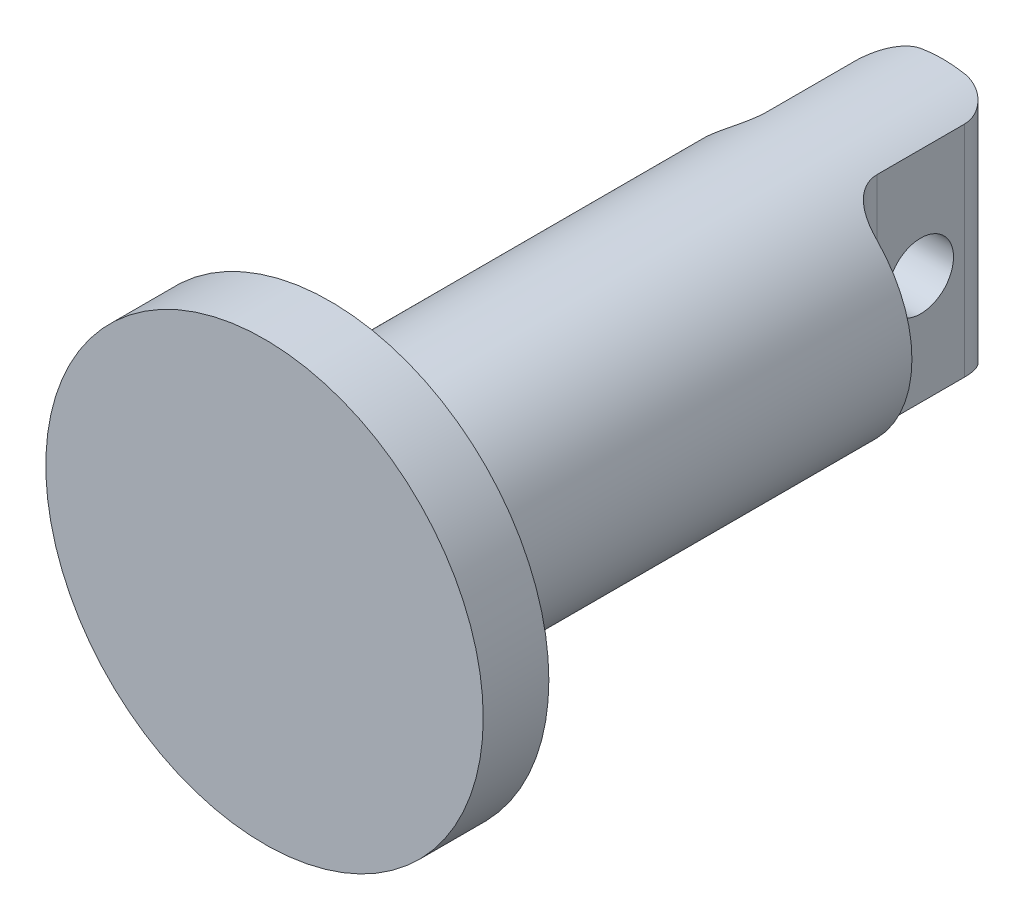
ISO-10303-21;
HEADER;
FILE_DESCRIPTION(('STEP AP214'),'2;1');
FILE_NAME('part.step','',(''),(''),'','','');
FILE_SCHEMA(('AUTOMOTIVE_DESIGN { 1 0 10303 214 1 1 1 1 }'));
ENDSEC;
DATA;
#1=APPLICATION_CONTEXT('core data for automotive mechanical design processes');
#2=APPLICATION_PROTOCOL_DEFINITION('international standard','automotive_design',2000,#1);
#3=PRODUCT_CONTEXT('',#1,'mechanical');
#4=PRODUCT('Part','Part','',(#3));
#5=PRODUCT_RELATED_PRODUCT_CATEGORY('part','',(#4));
#6=PRODUCT_DEFINITION_FORMATION('','',#4);
#7=PRODUCT_DEFINITION_CONTEXT('part definition',#1,'design');
#8=PRODUCT_DEFINITION('design','',#6,#7);
#9=PRODUCT_DEFINITION_SHAPE('','',#8);
#10=(LENGTH_UNIT() NAMED_UNIT(*) SI_UNIT(.MILLI.,.METRE.));
#11=(NAMED_UNIT(*) PLANE_ANGLE_UNIT() SI_UNIT($,.RADIAN.));
#12=(NAMED_UNIT(*) SI_UNIT($,.STERADIAN.) SOLID_ANGLE_UNIT());
#13=UNCERTAINTY_MEASURE_WITH_UNIT(LENGTH_MEASURE(1.E-05),#10,'distance_accuracy_value','');
#14=(GEOMETRIC_REPRESENTATION_CONTEXT(3) GLOBAL_UNCERTAINTY_ASSIGNED_CONTEXT((#13)) GLOBAL_UNIT_ASSIGNED_CONTEXT((#10,
#11,#12)) REPRESENTATION_CONTEXT('',''));
#15=CARTESIAN_POINT('',(0.,0.,0.));
#16=DIRECTION('',(0.,0.,1.));
#17=DIRECTION('',(1.,0.,0.));
#18=AXIS2_PLACEMENT_3D('',#15,#16,#17);
#19=CARTESIAN_POINT('',(0.,0.,0.));
#20=DIRECTION('',(0.,0.,1.));
#21=DIRECTION('',(1.,0.,0.));
#22=AXIS2_PLACEMENT_3D('',#19,#20,#21);
#23=PLANE('',#22);
#24=CARTESIAN_POINT('',(0.,0.,0.));
#25=DIRECTION('',(0.,0.,1.));
#26=DIRECTION('',(1.,0.,0.));
#27=AXIS2_PLACEMENT_3D('',#24,#25,#26);
#28=CIRCLE('',#27,8.6);
#29=CARTESIAN_POINT('',(8.6,0.,0.));
#30=VERTEX_POINT('',#29);
#31=EDGE_CURVE('E109',#30,#30,#28,.T.);
#32=ORIENTED_EDGE('',*,*,#31,.T.);
#33=EDGE_LOOP('',(#32));
#34=FACE_BOUND('',#33,.T.);
#35=CARTESIAN_POINT('',(0.,0.,0.));
#36=DIRECTION('',(0.,0.,1.));
#37=DIRECTION('',(1.,0.,0.));
#38=AXIS2_PLACEMENT_3D('',#35,#36,#37);
#39=CIRCLE('',#38,10.);
#40=CARTESIAN_POINT('',(10.,0.,0.));
#41=VERTEX_POINT('',#40);
#42=EDGE_CURVE('E234',#41,#41,#39,.T.);
#43=ORIENTED_EDGE('',*,*,#42,.F.);
#44=EDGE_LOOP('',(#43));
#45=FACE_BOUND('',#44,.T.);
#46=ADVANCED_FACE('F36',(#34,#45),#23,.F.);
#47=CARTESIAN_POINT('',(0.,0.,3.));
#48=DIRECTION('',(0.,0.,-1.));
#49=DIRECTION('',(-1.,0.,0.));
#50=AXIS2_PLACEMENT_3D('',#47,#48,#49);
#51=CYLINDRICAL_SURFACE('',#50,10.);
#52=CARTESIAN_POINT('',(0.,0.,3.));
#53=DIRECTION('',(0.,0.,1.));
#54=DIRECTION('',(1.,0.,0.));
#55=AXIS2_PLACEMENT_3D('',#52,#53,#54);
#56=CIRCLE('',#55,10.);
#57=CARTESIAN_POINT('',(10.,0.,3.));
#58=VERTEX_POINT('',#57);
#59=EDGE_CURVE('E355',#58,#58,#56,.T.);
#60=ORIENTED_EDGE('',*,*,#59,.F.);
#61=EDGE_LOOP('',(#60));
#62=FACE_BOUND('',#61,.T.);
#63=ORIENTED_EDGE('',*,*,#42,.T.);
#64=EDGE_LOOP('',(#63));
#65=FACE_BOUND('',#64,.T.);
#66=ADVANCED_FACE('F198',(#62,#65),#51,.T.);
#67=CARTESIAN_POINT('',(0.,0.,3.));
#68=DIRECTION('',(0.,0.,1.));
#69=DIRECTION('',(1.,0.,0.));
#70=AXIS2_PLACEMENT_3D('',#67,#68,#69);
#71=PLANE('',#70);
#72=ORIENTED_EDGE('',*,*,#59,.T.);
#73=EDGE_LOOP('',(#72));
#74=FACE_BOUND('',#73,.T.);
#75=ADVANCED_FACE('F152',(#74),#71,.T.);
#76=CARTESIAN_POINT('',(0.,0.,-28.));
#77=DIRECTION('',(0.,0.,1.));
#78=DIRECTION('',(1.,0.,0.));
#79=AXIS2_PLACEMENT_3D('',#76,#77,#78);
#80=CYLINDRICAL_SURFACE('',#79,5.6);
#81=CARTESIAN_POINT('',(0.,0.,-3.));
#82=DIRECTION('',(0.,0.,1.));
#83=DIRECTION('',(1.,0.,0.));
#84=AXIS2_PLACEMENT_3D('',#81,#82,#83);
#85=CIRCLE('',#84,5.6);
#86=CARTESIAN_POINT('',(5.6,0.,-3.));
#87=VERTEX_POINT('',#86);
#88=EDGE_CURVE('E124',#87,#87,#85,.F.);
#89=ORIENTED_EDGE('',*,*,#88,.T.);
#90=EDGE_LOOP('',(#89));
#91=FACE_BOUND('',#90,.T.);
#92=DIRECTION('',(0.,0.,1.));
#93=VECTOR('',#92,1.);
#94=CARTESIAN_POINT('',(-2.5,-5.01098792654702,-28.));
#95=LINE('',#94,#93);
#96=CARTESIAN_POINT('',(-2.5,-5.01098792654702,-22.5));
#97=VERTEX_POINT('',#96);
#98=CARTESIAN_POINT('',(-2.5,-5.01098792654702,-26.5));
#99=VERTEX_POINT('',#98);
#100=EDGE_CURVE('E107',#97,#99,#95,.F.);
#101=ORIENTED_EDGE('',*,*,#100,.T.);
#102=CARTESIAN_POINT('',(-2.5,-5.01098792654702,-26.5));
#103=CARTESIAN_POINT('',(-2.5000020804932,-5.01098386540568,-26.5395725011254));
#104=CARTESIAN_POINT('',(-2.49843294481036,-5.01177002350182,-26.5791239922962));
#105=CARTESIAN_POINT('',(-2.49218861536451,-5.01487928972236,-26.6579048751711));
#106=CARTESIAN_POINT('',(-2.48751464530948,-5.017201792326,-26.6971343876123));
#107=CARTESIAN_POINT('',(-2.46895310911888,-5.02637746679336,-26.8135594581204));
#108=CARTESIAN_POINT('',(-2.45052502289085,-5.03543974754558,-26.88991104718));
#109=CARTESIAN_POINT('',(-2.40237161237888,-5.05858790620674,-27.0379794446277));
#110=CARTESIAN_POINT('',(-2.37265886624782,-5.07266818985616,-27.1097013096591));
#111=CARTESIAN_POINT('',(-2.30298371585328,-5.10467755632711,-27.2471099442359));
#112=CARTESIAN_POINT('',(-2.2630111953227,-5.12261043499499,-27.312790669817));
#113=CARTESIAN_POINT('',(-2.17141281857219,-5.16213023737658,-27.4403776451357));
#114=CARTESIAN_POINT('',(-2.11924950501062,-5.18386787648468,-27.5018504279728));
#115=CARTESIAN_POINT('',(-2.00607340449965,-5.22870677700186,-27.615459784027));
#116=CARTESIAN_POINT('',(-1.94505678929908,-5.25180862573225,-27.6675922965179));
#117=CARTESIAN_POINT('',(-1.81019268688119,-5.29987993214784,-27.7653363169122));
#118=CARTESIAN_POINT('',(-1.73570424955865,-5.32484780646085,-27.8100673581615));
#119=CARTESIAN_POINT('',(-1.57974465073417,-5.37317998442629,-27.886151142896));
#120=CARTESIAN_POINT('',(-1.49827861035609,-5.39654544185285,-27.9175135987391));
#121=CARTESIAN_POINT('',(-1.34760565609259,-5.43587189487601,-27.960819199001));
#122=CARTESIAN_POINT('',(-1.27929438996599,-5.45237039149003,-27.9754206613721));
#123=CARTESIAN_POINT('',(-1.14076362477681,-5.48304543588229,-27.9950256519124));
#124=CARTESIAN_POINT('',(-1.07054304586715,-5.49722063643315,-28.0000236291209));
#125=CARTESIAN_POINT('',(-1.,-5.50999092558236,-28.));
#126=B_SPLINE_CURVE_WITH_KNOTS('',3,(#102,#103,#104,#105,#106,#107,#108,#109,#110,#111,#112,
#113,#114,#115,#116,#117,#118,#119,#120,#121,#122,#123,#124,#125),.UNSPECIFIED.,.F.,.F.,(4,2,2,
2,2,2,2,2,2,2,2,4),(0.,0.118637964226892,0.237229197409221,0.473170501747675,0.708849588412842,
0.944761956370705,1.19422423603551,1.44379470880183,1.7137504722233,1.98350977549837,
2.19815830777773,2.41293087289718),.UNSPECIFIED.);
#127=CARTESIAN_POINT('',(-1.,-5.50999092558236,-28.));
#128=VERTEX_POINT('',#127);
#129=EDGE_CURVE('E167',#99,#128,#126,.T.);
#130=ORIENTED_EDGE('',*,*,#129,.T.);
#131=CARTESIAN_POINT('',(0.,0.,-28.));
#132=DIRECTION('',(0.,0.,-1.));
#133=DIRECTION('',(-1.,0.,0.));
#134=AXIS2_PLACEMENT_3D('',#131,#132,#133);
#135=CIRCLE('',#134,5.6);
#136=CARTESIAN_POINT('',(1.,-5.50999092558236,-28.));
#137=VERTEX_POINT('',#136);
#138=EDGE_CURVE('E235',#137,#128,#135,.T.);
#139=ORIENTED_EDGE('',*,*,#138,.F.);
#140=CARTESIAN_POINT('',(1.,-5.50999092558236,-28.));
#141=CARTESIAN_POINT('',(1.0431357750744,-5.50216525904986,-28.0000002889022));
#142=CARTESIAN_POINT('',(1.08615359317973,-5.49383123010131,-27.9981384460265));
#143=CARTESIAN_POINT('',(1.17166685141476,-5.47623015731936,-27.9907624586411));
#144=CARTESIAN_POINT('',(1.21416247296195,-5.46696344841963,-27.9852496212957));
#145=CARTESIAN_POINT('',(1.3401887639641,-5.43794852352108,-27.9633914739219));
#146=CARTESIAN_POINT('',(1.42256390588289,-5.41692970323941,-27.9417254477834));
#147=CARTESIAN_POINT('',(1.58180278663491,-5.37259209995911,-27.8851540203785));
#148=CARTESIAN_POINT('',(1.65867169675423,-5.34927552517556,-27.8502612403694));
#149=CARTESIAN_POINT('',(1.80531751706315,-5.30158259710547,-27.7682756767982));
#150=CARTESIAN_POINT('',(1.87508918255689,-5.2772054788231,-27.7211739610188));
#151=CARTESIAN_POINT('',(2.00835566901939,-5.22797720762672,-27.6139160966464));
#152=CARTESIAN_POINT('',(2.07151596208769,-5.20314268003664,-27.5533357924905));
#153=CARTESIAN_POINT('',(2.18673797636213,-5.15577972730389,-27.4215791801319));
#154=CARTESIAN_POINT('',(2.23879824157279,-5.1332516048946,-27.3504014839417));
#155=CARTESIAN_POINT('',(2.32948785162619,-5.0927330594954,-27.2000525597936));
#156=CARTESIAN_POINT('',(2.36827835891485,-5.07468897321799,-27.1209935103895));
#157=CARTESIAN_POINT('',(2.43160009913251,-5.04465718708589,-26.9563554350108));
#158=CARTESIAN_POINT('',(2.45616029662659,-5.03265719156463,-26.8707900567923));
#159=CARTESIAN_POINT('',(2.48193557874058,-5.01996911315989,-26.7369083960247));
#160=CARTESIAN_POINT('',(2.48869640698838,-5.01661546402954,-26.6898457537173));
#161=CARTESIAN_POINT('',(2.49773104489937,-5.01212031245242,-26.5951999860403));
#162=CARTESIAN_POINT('',(2.50000596090449,-5.01097826456884,-26.5476169919148));
#163=CARTESIAN_POINT('',(2.5,-5.01098792654702,-26.5));
#164=B_SPLINE_CURVE_WITH_KNOTS('',3,(#140,#141,#142,#143,#144,#145,#146,#147,#148,#149,#150,
#151,#152,#153,#154,#155,#156,#157,#158,#159,#160,#161,#162,#163),.UNSPECIFIED.,.F.,.F.,(4,2,2,
2,2,2,2,2,2,2,2,4),(0.,0.131429504807568,0.262811979376038,0.524658963023519,0.786256712976935,
1.04804639414124,1.31967659915426,1.59134241212977,1.85958079849224,2.12727127325902,
2.27002499369473,2.4127435029665),.UNSPECIFIED.);
#165=CARTESIAN_POINT('',(2.5,-5.01098792654702,-26.5));
#166=VERTEX_POINT('',#165);
#167=EDGE_CURVE('E132',#137,#166,#164,.T.);
#168=ORIENTED_EDGE('',*,*,#167,.T.);
#169=DIRECTION('',(0.,0.,1.));
#170=VECTOR('',#169,1.);
#171=CARTESIAN_POINT('',(2.5,-5.01098792654702,-28.));
#172=LINE('',#171,#170);
#173=CARTESIAN_POINT('',(2.5,-5.01098792654702,-22.5));
#174=VERTEX_POINT('',#173);
#175=EDGE_CURVE('E119',#166,#174,#172,.T.);
#176=ORIENTED_EDGE('',*,*,#175,.T.);
#177=CARTESIAN_POINT('',(2.5,-5.01098792654702,-22.5));
#178=CARTESIAN_POINT('',(2.49999844532188,-5.01098605975963,-22.4616087248729));
#179=CARTESIAN_POINT('',(2.50147503292777,-5.01025231108213,-22.4232363931987));
#180=CARTESIAN_POINT('',(2.50735348108305,-5.00731410603619,-22.3467785175572));
#181=CARTESIAN_POINT('',(2.51175493108791,-5.00510985607259,-22.3086929340996));
#182=CARTESIAN_POINT('',(2.52926194656355,-4.99630013425496,-22.1954739584162));
#183=CARTESIAN_POINT('',(2.54667063879383,-4.98749773902104,-22.1211207884798));
#184=CARTESIAN_POINT('',(2.59216946245848,-4.96400076184108,-21.9767905047417));
#185=CARTESIAN_POINT('',(2.62026021251362,-4.94930583864348,-21.9068136446547));
#186=CARTESIAN_POINT('',(2.68583584980902,-4.91402750126924,-21.7730039536221));
#187=CARTESIAN_POINT('',(2.72332327114746,-4.89344249844124,-21.709172786487));
#188=CARTESIAN_POINT('',(2.80690028343339,-4.8459942461289,-21.5878278514886));
#189=CARTESIAN_POINT('',(2.85315683574015,-4.81900603636376,-21.5304785632747));
#190=CARTESIAN_POINT('',(2.95167990030185,-4.75929602991547,-21.4247089164592));
#191=CARTESIAN_POINT('',(3.00394464051543,-4.72657592230139,-21.3762859360669));
#192=CARTESIAN_POINT('',(3.11692455378362,-4.65292232365463,-21.2851460559756));
#193=CARTESIAN_POINT('',(3.1779812305425,-4.61153525982092,-21.2432230603618));
#194=CARTESIAN_POINT('',(3.30259788637748,-4.52312917531629,-21.1700105708581));
#195=CARTESIAN_POINT('',(3.36616437104541,-4.476094772014,-21.1387510539356));
#196=CARTESIAN_POINT('',(3.47863230154504,-4.38895526792786,-21.0925366978604));
#197=CARTESIAN_POINT('',(3.52745519326801,-4.34983358810063,-21.0754750754576));
#198=CARTESIAN_POINT('',(3.624733043728,-4.26911086138937,-21.0468148597547));
#199=CARTESIAN_POINT('',(3.67318758591487,-4.2275073753211,-21.0352217441161));
#200=CARTESIAN_POINT('',(3.76886997937974,-4.14242568117838,-21.0171181181185));
#201=CARTESIAN_POINT('',(3.8161032057753,-4.09895936269225,-21.0105793259212));
#202=CARTESIAN_POINT('',(3.90916509774067,-4.01030876341671,-21.0020267392921));
#203=CARTESIAN_POINT('',(3.95499655700509,-3.96512836484636,-21.0000032754364));
#204=CARTESIAN_POINT('',(4.,-3.91918358845308,-21.));
#205=B_SPLINE_CURVE_WITH_KNOTS('',3,(#177,#178,#179,#180,#181,#182,#183,#184,#185,#186,#187,
#188,#189,#190,#191,#192,#193,#194,#195,#196,#197,#198,#199,#200,#201,#202,#203,#204),
.UNSPECIFIED.,.F.,.F.,(4,2,2,2,2,2,2,2,2,2,2,2,2,4),(0.,0.115101046934983,0.230185941272074,
0.459593197899067,0.689013742013863,0.918496223045591,1.15289102850619,1.38721687860824,
1.64076447615015,1.8950190787028,2.089284445406,2.28374399162558,2.47710738617681,
2.6700563005188),.UNSPECIFIED.);
#206=CARTESIAN_POINT('',(4.,-3.91918358845308,-21.));
#207=VERTEX_POINT('',#206);
#208=EDGE_CURVE('E12',#174,#207,#205,.T.);
#209=ORIENTED_EDGE('',*,*,#208,.T.);
#210=CARTESIAN_POINT('',(0.,0.,-21.));
#211=DIRECTION('',(0.,0.,-1.));
#212=DIRECTION('',(-1.,0.,0.));
#213=AXIS2_PLACEMENT_3D('',#210,#211,#212);
#214=CIRCLE('',#213,5.6);
#215=CARTESIAN_POINT('',(4.,3.91918358845308,-21.));
#216=VERTEX_POINT('',#215);
#217=EDGE_CURVE('E122',#216,#207,#214,.T.);
#218=ORIENTED_EDGE('',*,*,#217,.F.);
#219=CARTESIAN_POINT('',(4.,3.91918358845308,-21.));
#220=CARTESIAN_POINT('',(3.9557336803865,3.96437492473145,-21.0000033469822));
#221=CARTESIAN_POINT('',(3.91066820298925,4.00882603571216,-21.001960904263));
#222=CARTESIAN_POINT('',(3.81918676707573,4.09607014262874,-21.0102269052185));
#223=CARTESIAN_POINT('',(3.77276836887405,4.1388597710828,-21.0165437429517));
#224=CARTESIAN_POINT('',(3.67865738367702,4.22273424589004,-21.0340382842501));
#225=CARTESIAN_POINT('',(3.63095793272987,4.26380422561554,-21.0452514247408));
#226=CARTESIAN_POINT('',(3.53517126489213,4.34355264612186,-21.0729679651696));
#227=CARTESIAN_POINT('',(3.48708440180229,4.38223303908223,-21.0894669767605));
#228=CARTESIAN_POINT('',(3.36770023341093,4.47512441155301,-21.1376084788785));
#229=CARTESIAN_POINT('',(3.29649458651222,4.52773396683387,-21.1727131624566));
#230=CARTESIAN_POINT('',(3.15741936012218,4.62578965948223,-21.2563691011738));
#231=CARTESIAN_POINT('',(3.08954041268094,4.67125681502645,-21.3048796978459));
#232=CARTESIAN_POINT('',(2.95967539347949,4.75461124064817,-21.4159885788762));
#233=CARTESIAN_POINT('',(2.8977435397363,4.7924317165616,-21.4787016416199));
#234=CARTESIAN_POINT('',(2.7841641032247,4.85930002163556,-21.6169749042305));
#235=CARTESIAN_POINT('',(2.73251858454951,4.88834609069483,-21.6925376769387));
#236=CARTESIAN_POINT('',(2.64857801238486,4.9342724729647,-21.844085980049));
#237=CARTESIAN_POINT('',(2.6146816186877,4.95221168523887,-21.918868913277));
#238=CARTESIAN_POINT('',(2.55937136974278,4.98102422435756,-22.074143720394));
#239=CARTESIAN_POINT('',(2.5379390462439,4.99190800812404,-22.1546269485125));
#240=CARTESIAN_POINT('',(2.51557298798128,5.00319512688941,-22.2799333289134));
#241=CARTESIAN_POINT('',(2.5097391768057,5.00612014491925,-22.3237216604271));
#242=CARTESIAN_POINT('',(2.50195365053542,5.01001359195367,-22.4116649506208));
#243=CARTESIAN_POINT('',(2.49999639781366,5.01098481197141,-22.4558192957153));
#244=CARTESIAN_POINT('',(2.5,5.01098792654702,-22.5));
#245=B_SPLINE_CURVE_WITH_KNOTS('',3,(#219,#220,#221,#222,#223,#224,#225,#226,#227,#228,#229,
#230,#231,#232,#233,#234,#235,#236,#237,#238,#239,#240,#241,#242,#243,#244),.UNSPECIFIED.,.F.,
.F.,(4,2,2,2,2,2,2,2,2,2,2,2,4),(0.,0.189784007279752,0.379934478566911,0.571484582290015,
0.762876070802287,1.04739762955487,1.33106556508882,1.61711342007846,1.90321861676456,
2.15402154935302,2.40445190932844,2.53707794764393,2.66951439388349),.UNSPECIFIED.);
#246=CARTESIAN_POINT('',(2.5,5.01098792654702,-22.5));
#247=VERTEX_POINT('',#246);
#248=EDGE_CURVE('E48',#216,#247,#245,.T.);
#249=ORIENTED_EDGE('',*,*,#248,.T.);
#250=DIRECTION('',(0.,0.,1.));
#251=VECTOR('',#250,1.);
#252=CARTESIAN_POINT('',(2.5,5.01098792654702,-28.));
#253=LINE('',#252,#251);
#254=CARTESIAN_POINT('',(2.5,5.01098792654702,-26.5));
#255=VERTEX_POINT('',#254);
#256=EDGE_CURVE('E227',#247,#255,#253,.F.);
#257=ORIENTED_EDGE('',*,*,#256,.T.);
#258=CARTESIAN_POINT('',(2.5,5.01098792654702,-26.5));
#259=CARTESIAN_POINT('',(2.5000020804932,5.01098386540568,-26.5395725011254));
#260=CARTESIAN_POINT('',(2.49843294481036,5.01177002350182,-26.5791239922962));
#261=CARTESIAN_POINT('',(2.49218861536451,5.01487928972236,-26.6579048751711));
#262=CARTESIAN_POINT('',(2.48751464530948,5.017201792326,-26.6971343876123));
#263=CARTESIAN_POINT('',(2.46895310911888,5.02637746679336,-26.8135594581204));
#264=CARTESIAN_POINT('',(2.45052502289085,5.03543974754558,-26.88991104718));
#265=CARTESIAN_POINT('',(2.40237161237888,5.05858790620674,-27.0379794446277));
#266=CARTESIAN_POINT('',(2.37265886624782,5.07266818985616,-27.1097013096591));
#267=CARTESIAN_POINT('',(2.30298371585328,5.10467755632711,-27.2471099442359));
#268=CARTESIAN_POINT('',(2.2630111953227,5.12261043499499,-27.312790669817));
#269=CARTESIAN_POINT('',(2.17141281857219,5.16213023737658,-27.4403776451357));
#270=CARTESIAN_POINT('',(2.11924950501062,5.18386787648468,-27.5018504279728));
#271=CARTESIAN_POINT('',(2.00607340449965,5.22870677700186,-27.615459784027));
#272=CARTESIAN_POINT('',(1.94505678929908,5.25180862573225,-27.6675922965179));
#273=CARTESIAN_POINT('',(1.81019268688119,5.29987993214784,-27.7653363169122));
#274=CARTESIAN_POINT('',(1.73570424955865,5.32484780646085,-27.8100673581615));
#275=CARTESIAN_POINT('',(1.57974465073417,5.37317998442629,-27.886151142896));
#276=CARTESIAN_POINT('',(1.49827861035609,5.39654544185285,-27.9175135987391));
#277=CARTESIAN_POINT('',(1.34760565609259,5.43587189487601,-27.960819199001));
#278=CARTESIAN_POINT('',(1.27929438996599,5.45237039149003,-27.9754206613721));
#279=CARTESIAN_POINT('',(1.14076362477681,5.48304543588229,-27.9950256519124));
#280=CARTESIAN_POINT('',(1.07054304586715,5.49722063643315,-28.0000236291209));
#281=CARTESIAN_POINT('',(1.,5.50999092558236,-28.));
#282=B_SPLINE_CURVE_WITH_KNOTS('',3,(#258,#259,#260,#261,#262,#263,#264,#265,#266,#267,#268,
#269,#270,#271,#272,#273,#274,#275,#276,#277,#278,#279,#280,#281),.UNSPECIFIED.,.F.,.F.,(4,2,2,
2,2,2,2,2,2,2,2,4),(0.,0.118637964226892,0.237229197409221,0.473170501747675,0.708849588412842,
0.944761956370705,1.19422423603551,1.44379470880183,1.7137504722233,1.98350977549837,
2.19815830777773,2.41293087289718),.UNSPECIFIED.);
#283=CARTESIAN_POINT('',(1.,5.50999092558236,-28.));
#284=VERTEX_POINT('',#283);
#285=EDGE_CURVE('E138',#255,#284,#282,.T.);
#286=ORIENTED_EDGE('',*,*,#285,.T.);
#287=CARTESIAN_POINT('',(-1.,5.50999092558236,-28.));
#288=VERTEX_POINT('',#287);
#289=EDGE_CURVE('E225',#288,#284,#135,.T.);
#290=ORIENTED_EDGE('',*,*,#289,.F.);
#291=CARTESIAN_POINT('',(-1.,5.50999092558236,-28.));
#292=CARTESIAN_POINT('',(-1.0431357750744,5.50216525904986,-28.0000002889022));
#293=CARTESIAN_POINT('',(-1.08615359317973,5.49383123010131,-27.9981384460265));
#294=CARTESIAN_POINT('',(-1.17166685141476,5.47623015731936,-27.9907624586411));
#295=CARTESIAN_POINT('',(-1.21416247296195,5.46696344841963,-27.9852496212957));
#296=CARTESIAN_POINT('',(-1.3401887639641,5.43794852352108,-27.9633914739219));
#297=CARTESIAN_POINT('',(-1.42256390588289,5.41692970323941,-27.9417254477834));
#298=CARTESIAN_POINT('',(-1.58180278663491,5.37259209995911,-27.8851540203785));
#299=CARTESIAN_POINT('',(-1.65867169675423,5.34927552517556,-27.8502612403694));
#300=CARTESIAN_POINT('',(-1.80531751706315,5.30158259710547,-27.7682756767982));
#301=CARTESIAN_POINT('',(-1.87508918255689,5.2772054788231,-27.7211739610188));
#302=CARTESIAN_POINT('',(-2.00835566901939,5.22797720762672,-27.6139160966464));
#303=CARTESIAN_POINT('',(-2.07151596208769,5.20314268003664,-27.5533357924905));
#304=CARTESIAN_POINT('',(-2.18673797636213,5.15577972730389,-27.4215791801319));
#305=CARTESIAN_POINT('',(-2.23879824157279,5.1332516048946,-27.3504014839417));
#306=CARTESIAN_POINT('',(-2.32948785162619,5.0927330594954,-27.2000525597936));
#307=CARTESIAN_POINT('',(-2.36827835891485,5.07468897321799,-27.1209935103895));
#308=CARTESIAN_POINT('',(-2.43160009913251,5.04465718708589,-26.9563554350108));
#309=CARTESIAN_POINT('',(-2.45616029662659,5.03265719156463,-26.8707900567923));
#310=CARTESIAN_POINT('',(-2.48193557874058,5.01996911315989,-26.7369083960247));
#311=CARTESIAN_POINT('',(-2.48869640698838,5.01661546402954,-26.6898457537173));
#312=CARTESIAN_POINT('',(-2.49773104489937,5.01212031245242,-26.5951999860403));
#313=CARTESIAN_POINT('',(-2.50000596090449,5.01097826456884,-26.5476169919148));
#314=CARTESIAN_POINT('',(-2.5,5.01098792654702,-26.5));
#315=B_SPLINE_CURVE_WITH_KNOTS('',3,(#291,#292,#293,#294,#295,#296,#297,#298,#299,#300,#301,
#302,#303,#304,#305,#306,#307,#308,#309,#310,#311,#312,#313,#314),.UNSPECIFIED.,.F.,.F.,(4,2,2,
2,2,2,2,2,2,2,2,4),(0.,0.131429504807568,0.262811979376038,0.524658963023519,0.786256712976935,
1.04804639414124,1.31967659915426,1.59134241212977,1.85958079849224,2.12727127325902,
2.27002499369473,2.4127435029665),.UNSPECIFIED.);
#316=CARTESIAN_POINT('',(-2.5,5.01098792654702,-26.5));
#317=VERTEX_POINT('',#316);
#318=EDGE_CURVE('E161',#288,#317,#315,.T.);
#319=ORIENTED_EDGE('',*,*,#318,.T.);
#320=DIRECTION('',(0.,0.,1.));
#321=VECTOR('',#320,1.);
#322=CARTESIAN_POINT('',(-2.5,5.01098792654702,-28.));
#323=LINE('',#322,#321);
#324=CARTESIAN_POINT('',(-2.5,5.01098792654702,-22.5));
#325=VERTEX_POINT('',#324);
#326=EDGE_CURVE('E118',#317,#325,#323,.T.);
#327=ORIENTED_EDGE('',*,*,#326,.T.);
#328=CARTESIAN_POINT('',(-2.5,5.01098792654702,-22.5));
#329=CARTESIAN_POINT('',(-2.49999844532188,5.01098605975963,-22.4616087248729));
#330=CARTESIAN_POINT('',(-2.50147503292777,5.01025231108213,-22.4232363931987));
#331=CARTESIAN_POINT('',(-2.50735348108305,5.00731410603619,-22.3467785175572));
#332=CARTESIAN_POINT('',(-2.51175493108791,5.00510985607259,-22.3086929340996));
#333=CARTESIAN_POINT('',(-2.52926194656355,4.99630013425496,-22.1954739584162));
#334=CARTESIAN_POINT('',(-2.54667063879383,4.98749773902104,-22.1211207884798));
#335=CARTESIAN_POINT('',(-2.59216946245848,4.96400076184108,-21.9767905047417));
#336=CARTESIAN_POINT('',(-2.62026021251362,4.94930583864348,-21.9068136446547));
#337=CARTESIAN_POINT('',(-2.68583584980902,4.91402750126924,-21.7730039536221));
#338=CARTESIAN_POINT('',(-2.72332327114746,4.89344249844124,-21.709172786487));
#339=CARTESIAN_POINT('',(-2.80690028343339,4.8459942461289,-21.5878278514886));
#340=CARTESIAN_POINT('',(-2.85315683574015,4.81900603636376,-21.5304785632747));
#341=CARTESIAN_POINT('',(-2.95167990030185,4.75929602991547,-21.4247089164592));
#342=CARTESIAN_POINT('',(-3.00394464051543,4.72657592230139,-21.3762859360669));
#343=CARTESIAN_POINT('',(-3.11692455378362,4.65292232365463,-21.2851460559756));
#344=CARTESIAN_POINT('',(-3.1779812305425,4.61153525982092,-21.2432230603618));
#345=CARTESIAN_POINT('',(-3.30259788637748,4.52312917531629,-21.1700105708581));
#346=CARTESIAN_POINT('',(-3.36616437104541,4.476094772014,-21.1387510539356));
#347=CARTESIAN_POINT('',(-3.47863230154504,4.38895526792786,-21.0925366978604));
#348=CARTESIAN_POINT('',(-3.52745519326801,4.34983358810063,-21.0754750754576));
#349=CARTESIAN_POINT('',(-3.624733043728,4.26911086138937,-21.0468148597547));
#350=CARTESIAN_POINT('',(-3.67318758591487,4.2275073753211,-21.0352217441161));
#351=CARTESIAN_POINT('',(-3.76886997937974,4.14242568117838,-21.0171181181185));
#352=CARTESIAN_POINT('',(-3.8161032057753,4.09895936269225,-21.0105793259212));
#353=CARTESIAN_POINT('',(-3.90916509774067,4.01030876341671,-21.0020267392921));
#354=CARTESIAN_POINT('',(-3.95499655700509,3.96512836484636,-21.0000032754364));
#355=CARTESIAN_POINT('',(-4.,3.91918358845308,-21.));
#356=B_SPLINE_CURVE_WITH_KNOTS('',3,(#328,#329,#330,#331,#332,#333,#334,#335,#336,#337,#338,
#339,#340,#341,#342,#343,#344,#345,#346,#347,#348,#349,#350,#351,#352,#353,#354,#355),
.UNSPECIFIED.,.F.,.F.,(4,2,2,2,2,2,2,2,2,2,2,2,2,4),(0.,0.115101046934983,0.230185941272074,
0.459593197899067,0.689013742013863,0.918496223045591,1.15289102850619,1.38721687860824,
1.64076447615015,1.8950190787028,2.089284445406,2.28374399162558,2.47710738617681,
2.6700563005188),.UNSPECIFIED.);
#357=CARTESIAN_POINT('',(-4.,3.91918358845308,-21.));
#358=VERTEX_POINT('',#357);
#359=EDGE_CURVE('E63',#325,#358,#356,.T.);
#360=ORIENTED_EDGE('',*,*,#359,.T.);
#361=CARTESIAN_POINT('',(0.,0.,-21.));
#362=DIRECTION('',(0.,0.,1.));
#363=DIRECTION('',(1.,0.,0.));
#364=AXIS2_PLACEMENT_3D('',#361,#362,#363);
#365=CIRCLE('',#364,5.6);
#366=CARTESIAN_POINT('',(-4.,-3.91918358845308,-21.));
#367=VERTEX_POINT('',#366);
#368=EDGE_CURVE('E108',#358,#367,#365,.T.);
#369=ORIENTED_EDGE('',*,*,#368,.T.);
#370=CARTESIAN_POINT('',(-4.,-3.91918358845308,-21.));
#371=CARTESIAN_POINT('',(-3.9557336803865,-3.96437492473145,-21.0000033469822));
#372=CARTESIAN_POINT('',(-3.91066820298925,-4.00882603571216,-21.001960904263));
#373=CARTESIAN_POINT('',(-3.81918676707573,-4.09607014262874,-21.0102269052185));
#374=CARTESIAN_POINT('',(-3.77276836887405,-4.1388597710828,-21.0165437429517));
#375=CARTESIAN_POINT('',(-3.67865738367702,-4.22273424589004,-21.0340382842501));
#376=CARTESIAN_POINT('',(-3.63095793272987,-4.26380422561554,-21.0452514247408));
#377=CARTESIAN_POINT('',(-3.53517126489213,-4.34355264612186,-21.0729679651696));
#378=CARTESIAN_POINT('',(-3.48708440180229,-4.38223303908223,-21.0894669767605));
#379=CARTESIAN_POINT('',(-3.36770023341093,-4.47512441155301,-21.1376084788785));
#380=CARTESIAN_POINT('',(-3.29649458651222,-4.52773396683387,-21.1727131624566));
#381=CARTESIAN_POINT('',(-3.15741936012218,-4.62578965948223,-21.2563691011738));
#382=CARTESIAN_POINT('',(-3.08954041268094,-4.67125681502645,-21.3048796978459));
#383=CARTESIAN_POINT('',(-2.95967539347949,-4.75461124064817,-21.4159885788762));
#384=CARTESIAN_POINT('',(-2.8977435397363,-4.7924317165616,-21.4787016416199));
#385=CARTESIAN_POINT('',(-2.7841641032247,-4.85930002163556,-21.6169749042305));
#386=CARTESIAN_POINT('',(-2.73251858454951,-4.88834609069483,-21.6925376769387));
#387=CARTESIAN_POINT('',(-2.64857801238486,-4.9342724729647,-21.844085980049));
#388=CARTESIAN_POINT('',(-2.6146816186877,-4.95221168523887,-21.918868913277));
#389=CARTESIAN_POINT('',(-2.55937136974278,-4.98102422435756,-22.074143720394));
#390=CARTESIAN_POINT('',(-2.5379390462439,-4.99190800812404,-22.1546269485125));
#391=CARTESIAN_POINT('',(-2.51557298798128,-5.00319512688941,-22.2799333289134));
#392=CARTESIAN_POINT('',(-2.5097391768057,-5.00612014491925,-22.3237216604271));
#393=CARTESIAN_POINT('',(-2.50195365053542,-5.01001359195367,-22.4116649506208));
#394=CARTESIAN_POINT('',(-2.49999639781366,-5.01098481197141,-22.4558192957153));
#395=CARTESIAN_POINT('',(-2.5,-5.01098792654702,-22.5));
#396=B_SPLINE_CURVE_WITH_KNOTS('',3,(#370,#371,#372,#373,#374,#375,#376,#377,#378,#379,#380,
#381,#382,#383,#384,#385,#386,#387,#388,#389,#390,#391,#392,#393,#394,#395),.UNSPECIFIED.,.F.,
.F.,(4,2,2,2,2,2,2,2,2,2,2,2,4),(0.,0.189784007279752,0.379934478566911,0.571484582290015,
0.762876070802287,1.04739762955487,1.33106556508882,1.61711342007846,1.90321861676456,
2.15402154935302,2.40445190932844,2.53707794764393,2.66951439388349),.UNSPECIFIED.);
#397=EDGE_CURVE('E55',#367,#97,#396,.T.);
#398=ORIENTED_EDGE('',*,*,#397,.T.);
#399=EDGE_LOOP('',(#101,#130,#139,#168,#176,#209,#218,#249,#257,#286,#290,#319,#327,#360,#369,#398));
#400=FACE_BOUND('',#399,.T.);
#401=ADVANCED_FACE('F106',(#91,#400),#80,.T.);
#402=CARTESIAN_POINT('',(0.,0.,-28.));
#403=DIRECTION('',(0.,0.,-1.));
#404=DIRECTION('',(-1.,0.,0.));
#405=AXIS2_PLACEMENT_3D('',#402,#403,#404);
#406=PLANE('',#405);
#407=ORIENTED_EDGE('',*,*,#138,.T.);
#408=DIRECTION('',(0.,-1.,0.));
#409=VECTOR('',#408,1.);
#410=CARTESIAN_POINT('',(-1.,5.01098792654702,-28.));
#411=LINE('',#410,#409);
#412=EDGE_CURVE('E220',#128,#288,#411,.F.);
#413=ORIENTED_EDGE('',*,*,#412,.T.);
#414=ORIENTED_EDGE('',*,*,#289,.T.);
#415=DIRECTION('',(0.,1.,0.));
#416=VECTOR('',#415,1.);
#417=CARTESIAN_POINT('',(1.,-5.01098792654702,-28.));
#418=LINE('',#417,#416);
#419=EDGE_CURVE('E222',#284,#137,#418,.F.);
#420=ORIENTED_EDGE('',*,*,#419,.T.);
#421=EDGE_LOOP('',(#407,#413,#414,#420));
#422=FACE_BOUND('',#421,.T.);
#423=ADVANCED_FACE('F151',(#422),#406,.T.);
#424=CARTESIAN_POINT('',(-0.625761910770769,-0.537352555701064,-21.));
#425=DIRECTION('',(0.,0.,1.));
#426=DIRECTION('',(1.,0.,0.));
#427=AXIS2_PLACEMENT_3D('',#424,#425,#426);
#428=PLANE('',#427);
#429=ORIENTED_EDGE('',*,*,#368,.F.);
#430=DIRECTION('',(0.,-1.,0.));
#431=VECTOR('',#430,1.);
#432=CARTESIAN_POINT('',(-4.,-5.01098792654702,-21.));
#433=LINE('',#432,#431);
#434=EDGE_CURVE('E244',#358,#367,#433,.T.);
#435=ORIENTED_EDGE('',*,*,#434,.T.);
#436=EDGE_LOOP('',(#429,#435));
#437=FACE_BOUND('',#436,.T.);
#438=ADVANCED_FACE('F303',(#437),#428,.F.);
#439=CARTESIAN_POINT('',(-2.5,0.,-21.));
#440=DIRECTION('',(1.,0.,0.));
#441=DIRECTION('',(0.,0.,-1.));
#442=AXIS2_PLACEMENT_3D('',#439,#440,#441);
#443=PLANE('',#442);
#444=CARTESIAN_POINT('',(-2.5,0.,-24.5));
#445=DIRECTION('',(1.,0.,0.));
#446=DIRECTION('',(0.,0.,-1.));
#447=AXIS2_PLACEMENT_3D('',#444,#445,#446);
#448=CIRCLE('',#447,1.5);
#449=CARTESIAN_POINT('',(-2.5,0.,-26.));
#450=VERTEX_POINT('',#449);
#451=EDGE_CURVE('E364',#450,#450,#448,.F.);
#452=ORIENTED_EDGE('',*,*,#451,.F.);
#453=EDGE_LOOP('',(#452));
#454=FACE_BOUND('',#453,.T.);
#455=ORIENTED_EDGE('',*,*,#326,.F.);
#456=DIRECTION('',(0.,-1.,0.));
#457=VECTOR('',#456,1.);
#458=CARTESIAN_POINT('',(-2.5,-5.01098792654702,-26.5));
#459=LINE('',#458,#457);
#460=EDGE_CURVE('E117',#317,#99,#459,.T.);
#461=ORIENTED_EDGE('',*,*,#460,.T.);
#462=ORIENTED_EDGE('',*,*,#100,.F.);
#463=DIRECTION('',(0.,-1.,0.));
#464=VECTOR('',#463,1.);
#465=CARTESIAN_POINT('',(-2.5,5.01098792654702,-22.5));
#466=LINE('',#465,#464);
#467=EDGE_CURVE('E115',#97,#325,#466,.F.);
#468=ORIENTED_EDGE('',*,*,#467,.T.);
#469=EDGE_LOOP('',(#455,#461,#462,#468));
#470=FACE_BOUND('',#469,.T.);
#471=ADVANCED_FACE('F114',(#454,#470),#443,.F.);
#472=CARTESIAN_POINT('',(0.0680037698119621,-0.537352555701064,-21.));
#473=DIRECTION('',(0.,0.,-1.));
#474=DIRECTION('',(-1.,0.,0.));
#475=AXIS2_PLACEMENT_3D('',#472,#473,#474);
#476=PLANE('',#475);
#477=ORIENTED_EDGE('',*,*,#217,.T.);
#478=DIRECTION('',(0.,1.,0.));
#479=VECTOR('',#478,1.);
#480=CARTESIAN_POINT('',(4.,-0.537352555701064,-21.));
#481=LINE('',#480,#479);
#482=EDGE_CURVE('E246',#207,#216,#481,.T.);
#483=ORIENTED_EDGE('',*,*,#482,.T.);
#484=EDGE_LOOP('',(#477,#483));
#485=FACE_BOUND('',#484,.T.);
#486=ADVANCED_FACE('F283',(#485),#476,.T.);
#487=CARTESIAN_POINT('',(2.5,0.,-21.));
#488=DIRECTION('',(-1.,0.,0.));
#489=DIRECTION('',(0.,0.,1.));
#490=AXIS2_PLACEMENT_3D('',#487,#488,#489);
#491=PLANE('',#490);
#492=CARTESIAN_POINT('',(2.5,0.,-24.5));
#493=DIRECTION('',(1.,0.,0.));
#494=DIRECTION('',(0.,0.,-1.));
#495=AXIS2_PLACEMENT_3D('',#492,#493,#494);
#496=CIRCLE('',#495,1.5);
#497=CARTESIAN_POINT('',(2.5,0.,-26.));
#498=VERTEX_POINT('',#497);
#499=EDGE_CURVE('E367',#498,#498,#496,.T.);
#500=ORIENTED_EDGE('',*,*,#499,.F.);
#501=EDGE_LOOP('',(#500));
#502=FACE_BOUND('',#501,.T.);
#503=ORIENTED_EDGE('',*,*,#175,.F.);
#504=DIRECTION('',(0.,1.,0.));
#505=VECTOR('',#504,1.);
#506=CARTESIAN_POINT('',(2.5,5.01098792654702,-26.5));
#507=LINE('',#506,#505);
#508=EDGE_CURVE('E242',#166,#255,#507,.T.);
#509=ORIENTED_EDGE('',*,*,#508,.T.);
#510=ORIENTED_EDGE('',*,*,#256,.F.);
#511=DIRECTION('',(0.,1.,0.));
#512=VECTOR('',#511,1.);
#513=CARTESIAN_POINT('',(2.5,0.,-22.5));
#514=LINE('',#513,#512);
#515=EDGE_CURVE('E238',#247,#174,#514,.F.);
#516=ORIENTED_EDGE('',*,*,#515,.T.);
#517=EDGE_LOOP('',(#503,#509,#510,#516));
#518=FACE_BOUND('',#517,.T.);
#519=ADVANCED_FACE('F215',(#502,#518),#491,.F.);
#520=CARTESIAN_POINT('',(-10.001,0.,-24.5));
#521=DIRECTION('',(1.,0.,0.));
#522=DIRECTION('',(0.,0.,-1.));
#523=AXIS2_PLACEMENT_3D('',#520,#521,#522);
#524=CYLINDRICAL_SURFACE('',#523,1.5);
#525=ORIENTED_EDGE('',*,*,#499,.T.);
#526=EDGE_LOOP('',(#525));
#527=FACE_BOUND('',#526,.T.);
#528=ORIENTED_EDGE('',*,*,#451,.T.);
#529=EDGE_LOOP('',(#528));
#530=FACE_BOUND('',#529,.T.);
#531=ADVANCED_FACE('F209',(#527,#530),#524,.F.);
#532=CARTESIAN_POINT('',(-1.,0.,-26.5));
#533=DIRECTION('',(0.,1.,0.));
#534=DIRECTION('',(0.,0.,1.));
#535=AXIS2_PLACEMENT_3D('',#532,#533,#534);
#536=CYLINDRICAL_SURFACE('',#535,1.5);
#537=ORIENTED_EDGE('',*,*,#318,.F.);
#538=ORIENTED_EDGE('',*,*,#412,.F.);
#539=ORIENTED_EDGE('',*,*,#129,.F.);
#540=ORIENTED_EDGE('',*,*,#460,.F.);
#541=EDGE_LOOP('',(#537,#538,#539,#540));
#542=FACE_BOUND('',#541,.T.);
#543=ADVANCED_FACE('F195',(#542),#536,.T.);
#544=CARTESIAN_POINT('',(1.,0.,-26.5));
#545=DIRECTION('',(0.,-1.,0.));
#546=DIRECTION('',(0.,0.,-1.));
#547=AXIS2_PLACEMENT_3D('',#544,#545,#546);
#548=CYLINDRICAL_SURFACE('',#547,1.5);
#549=ORIENTED_EDGE('',*,*,#167,.F.);
#550=ORIENTED_EDGE('',*,*,#419,.F.);
#551=ORIENTED_EDGE('',*,*,#285,.F.);
#552=ORIENTED_EDGE('',*,*,#508,.F.);
#553=EDGE_LOOP('',(#549,#550,#551,#552));
#554=FACE_BOUND('',#553,.T.);
#555=ADVANCED_FACE('F143',(#554),#548,.T.);
#556=CARTESIAN_POINT('',(-4.,-0.537352555701064,-22.5));
#557=DIRECTION('',(0.,1.,0.));
#558=DIRECTION('',(0.,0.,1.));
#559=AXIS2_PLACEMENT_3D('',#556,#557,#558);
#560=CYLINDRICAL_SURFACE('',#559,1.5);
#561=ORIENTED_EDGE('',*,*,#359,.F.);
#562=ORIENTED_EDGE('',*,*,#467,.F.);
#563=ORIENTED_EDGE('',*,*,#397,.F.);
#564=ORIENTED_EDGE('',*,*,#434,.F.);
#565=EDGE_LOOP('',(#561,#562,#563,#564));
#566=FACE_BOUND('',#565,.T.);
#567=ADVANCED_FACE('F121',(#566),#560,.F.);
#568=CARTESIAN_POINT('',(4.,-0.537352555701064,-22.5));
#569=DIRECTION('',(0.,1.,0.));
#570=DIRECTION('',(0.,0.,1.));
#571=AXIS2_PLACEMENT_3D('',#568,#569,#570);
#572=CYLINDRICAL_SURFACE('',#571,1.5);
#573=ORIENTED_EDGE('',*,*,#208,.F.);
#574=ORIENTED_EDGE('',*,*,#515,.F.);
#575=ORIENTED_EDGE('',*,*,#248,.F.);
#576=ORIENTED_EDGE('',*,*,#482,.F.);
#577=EDGE_LOOP('',(#573,#574,#575,#576));
#578=FACE_BOUND('',#577,.T.);
#579=ADVANCED_FACE('F184',(#578),#572,.F.);
#580=CARTESIAN_POINT('',(0.,0.,-3.));
#581=DIRECTION('',(0.,0.,1.));
#582=DIRECTION('',(1.,0.,0.));
#583=AXIS2_PLACEMENT_3D('',#580,#581,#582);
#584=TOROIDAL_SURFACE('',#583,8.6,3.);
#585=ORIENTED_EDGE('',*,*,#31,.F.);
#586=EDGE_LOOP('',(#585));
#587=FACE_BOUND('',#586,.T.);
#588=ORIENTED_EDGE('',*,*,#88,.F.);
#589=EDGE_LOOP('',(#588));
#590=FACE_BOUND('',#589,.T.);
#591=ADVANCED_FACE('F38',(#587,#590),#584,.F.);
#592=CLOSED_SHELL('',(#46,#66,#75,#401,#423,#438,#471,#486,#519,#531,#543,#555,#567,#579,#591));
#593=MANIFOLD_SOLID_BREP('B2',#592);
#594=ADVANCED_BREP_SHAPE_REPRESENTATION('',(#18,#593),#14);
#595=SHAPE_DEFINITION_REPRESENTATION(#9,#594);
ENDSEC;
END-ISO-10303-21;
